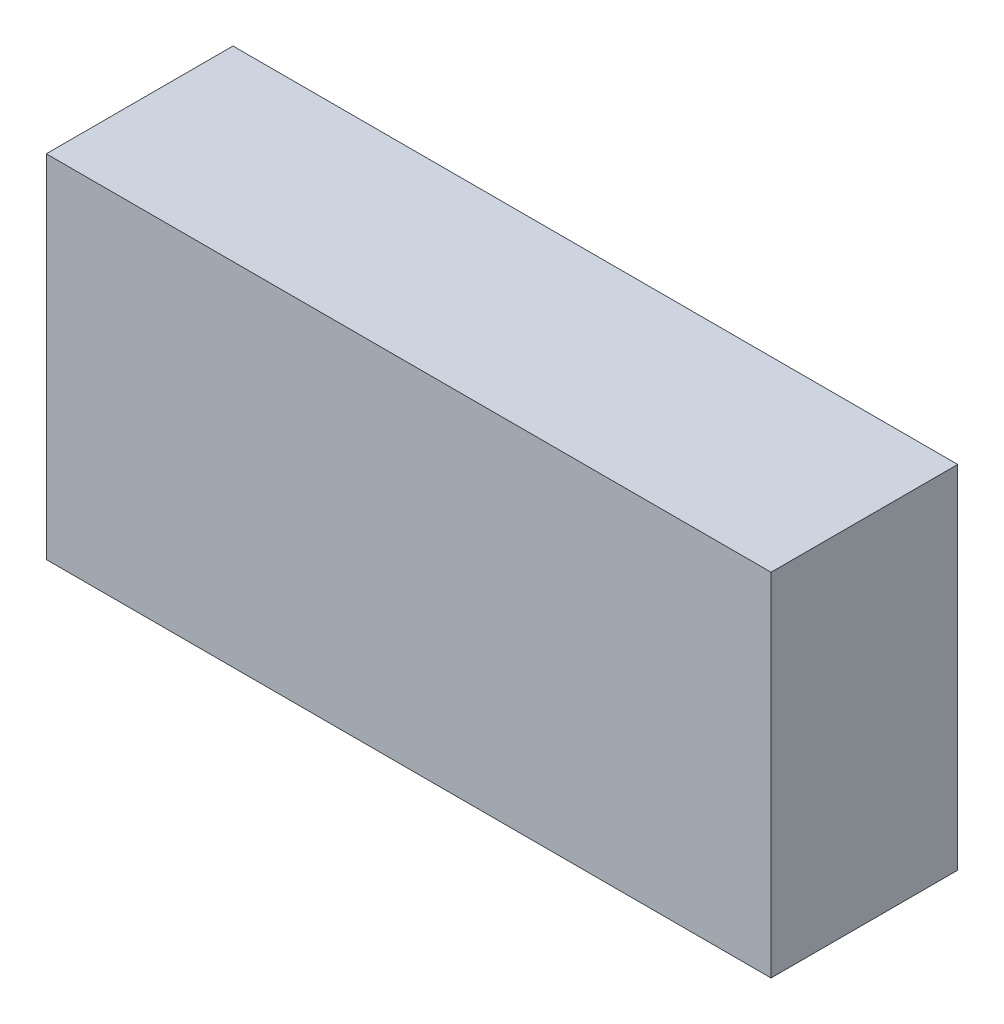
ISO-10303-21;
HEADER;
FILE_DESCRIPTION(('STEP AP214'),'2;1');
FILE_NAME('part.step','',(''),(''),'','','');
FILE_SCHEMA(('AUTOMOTIVE_DESIGN { 1 0 10303 214 1 1 1 1 }'));
ENDSEC;
DATA;
#1=APPLICATION_CONTEXT('core data for automotive mechanical design processes');
#2=APPLICATION_PROTOCOL_DEFINITION('international standard','automotive_design',2000,#1);
#3=PRODUCT_CONTEXT('',#1,'mechanical');
#4=PRODUCT('Part','Part','',(#3));
#5=PRODUCT_RELATED_PRODUCT_CATEGORY('part','',(#4));
#6=PRODUCT_DEFINITION_FORMATION('','',#4);
#7=PRODUCT_DEFINITION_CONTEXT('part definition',#1,'design');
#8=PRODUCT_DEFINITION('design','',#6,#7);
#9=PRODUCT_DEFINITION_SHAPE('','',#8);
#10=(LENGTH_UNIT() NAMED_UNIT(*) SI_UNIT(.MILLI.,.METRE.));
#11=(NAMED_UNIT(*) PLANE_ANGLE_UNIT() SI_UNIT($,.RADIAN.));
#12=(NAMED_UNIT(*) SI_UNIT($,.STERADIAN.) SOLID_ANGLE_UNIT());
#13=UNCERTAINTY_MEASURE_WITH_UNIT(LENGTH_MEASURE(1.E-05),#10,'distance_accuracy_value','');
#14=(GEOMETRIC_REPRESENTATION_CONTEXT(3) GLOBAL_UNCERTAINTY_ASSIGNED_CONTEXT((#13)) GLOBAL_UNIT_ASSIGNED_CONTEXT((#10,
#11,#12)) REPRESENTATION_CONTEXT('',''));
#15=CARTESIAN_POINT('',(0.,0.,0.));
#16=DIRECTION('',(0.,0.,1.));
#17=DIRECTION('',(1.,0.,0.));
#18=AXIS2_PLACEMENT_3D('',#15,#16,#17);
#19=CARTESIAN_POINT('',(-1.65,-0.8,0.));
#20=DIRECTION('',(1.,0.,0.));
#21=DIRECTION('',(0.,0.,1.));
#22=AXIS2_PLACEMENT_3D('',#19,#20,#21);
#23=PLANE('',#22);
#24=DIRECTION('',(0.,1.,0.));
#25=VECTOR('',#24,1.);
#26=CARTESIAN_POINT('',(-1.65,-0.8,0.85));
#27=LINE('',#26,#25);
#28=CARTESIAN_POINT('',(-1.65,-0.8,0.85));
#29=VERTEX_POINT('',#28);
#30=CARTESIAN_POINT('',(-1.65,0.800000000000001,0.85));
#31=VERTEX_POINT('',#30);
#32=EDGE_CURVE('P0_E11',#29,#31,#27,.T.);
#33=ORIENTED_EDGE('',*,*,#32,.T.);
#34=DIRECTION('',(0.,0.,1.));
#35=VECTOR('',#34,1.);
#36=CARTESIAN_POINT('',(-1.65,0.800000000000001,0.));
#37=LINE('',#36,#35);
#38=CARTESIAN_POINT('',(-1.65,0.800000000000001,0.));
#39=VERTEX_POINT('',#38);
#40=EDGE_CURVE('P0_E24',#39,#31,#37,.T.);
#41=ORIENTED_EDGE('',*,*,#40,.F.);
#42=DIRECTION('',(0.,1.,0.));
#43=VECTOR('',#42,1.);
#44=CARTESIAN_POINT('',(-1.65,-0.8,0.));
#45=LINE('',#44,#43);
#46=CARTESIAN_POINT('',(-1.65,-0.8,0.));
#47=VERTEX_POINT('',#46);
#48=EDGE_CURVE('P0_E86',#47,#39,#45,.T.);
#49=ORIENTED_EDGE('',*,*,#48,.F.);
#50=DIRECTION('',(0.,0.,1.));
#51=VECTOR('',#50,1.);
#52=CARTESIAN_POINT('',(-1.65,-0.8,0.));
#53=LINE('',#52,#51);
#54=EDGE_CURVE('P0_E36',#47,#29,#53,.T.);
#55=ORIENTED_EDGE('',*,*,#54,.T.);
#56=EDGE_LOOP('',(#33,#41,#49,#55));
#57=FACE_BOUND('',#56,.T.);
#58=ADVANCED_FACE('P0_F17',(#57),#23,.F.);
#59=CARTESIAN_POINT('',(1.65,-0.8,0.));
#60=DIRECTION('',(1.,0.,0.));
#61=DIRECTION('',(0.,0.,1.));
#62=AXIS2_PLACEMENT_3D('',#59,#60,#61);
#63=PLANE('',#62);
#64=DIRECTION('',(0.,0.,1.));
#65=VECTOR('',#64,1.);
#66=CARTESIAN_POINT('',(1.65,-0.8,0.));
#67=LINE('',#66,#65);
#68=CARTESIAN_POINT('',(1.65,-0.8,0.));
#69=VERTEX_POINT('',#68);
#70=CARTESIAN_POINT('',(1.65,-0.8,0.85));
#71=VERTEX_POINT('',#70);
#72=EDGE_CURVE('P0_E83',#69,#71,#67,.T.);
#73=ORIENTED_EDGE('',*,*,#72,.F.);
#74=DIRECTION('',(0.,1.,0.));
#75=VECTOR('',#74,1.);
#76=CARTESIAN_POINT('',(1.65,-0.8,0.));
#77=LINE('',#76,#75);
#78=CARTESIAN_POINT('',(1.65,0.8,0.));
#79=VERTEX_POINT('',#78);
#80=EDGE_CURVE('P0_E63',#69,#79,#77,.T.);
#81=ORIENTED_EDGE('',*,*,#80,.T.);
#82=DIRECTION('',(0.,0.,1.));
#83=VECTOR('',#82,1.);
#84=CARTESIAN_POINT('',(1.65,0.8,0.));
#85=LINE('',#84,#83);
#86=CARTESIAN_POINT('',(1.65,0.8,0.85));
#87=VERTEX_POINT('',#86);
#88=EDGE_CURVE('P0_E57',#79,#87,#85,.T.);
#89=ORIENTED_EDGE('',*,*,#88,.T.);
#90=DIRECTION('',(0.,1.,0.));
#91=VECTOR('',#90,1.);
#92=CARTESIAN_POINT('',(1.65,-0.8,0.85));
#93=LINE('',#92,#91);
#94=EDGE_CURVE('P0_E60',#71,#87,#93,.T.);
#95=ORIENTED_EDGE('',*,*,#94,.F.);
#96=EDGE_LOOP('',(#73,#81,#89,#95));
#97=FACE_BOUND('',#96,.T.);
#98=ADVANCED_FACE('P0_F59',(#97),#63,.T.);
#99=CARTESIAN_POINT('',(-1.65,-0.8,0.));
#100=DIRECTION('',(0.,1.,0.));
#101=DIRECTION('',(0.,0.,1.));
#102=AXIS2_PLACEMENT_3D('',#99,#100,#101);
#103=PLANE('',#102);
#104=ORIENTED_EDGE('',*,*,#72,.T.);
#105=DIRECTION('',(1.,0.,0.));
#106=VECTOR('',#105,1.);
#107=CARTESIAN_POINT('',(-1.65,-0.8,0.85));
#108=LINE('',#107,#106);
#109=EDGE_CURVE('P0_E71',#29,#71,#108,.T.);
#110=ORIENTED_EDGE('',*,*,#109,.F.);
#111=ORIENTED_EDGE('',*,*,#54,.F.);
#112=DIRECTION('',(1.,0.,0.));
#113=VECTOR('',#112,1.);
#114=CARTESIAN_POINT('',(-1.65,-0.8,0.));
#115=LINE('',#114,#113);
#116=EDGE_CURVE('P0_E76',#47,#69,#115,.T.);
#117=ORIENTED_EDGE('',*,*,#116,.T.);
#118=EDGE_LOOP('',(#104,#110,#111,#117));
#119=FACE_BOUND('',#118,.T.);
#120=ADVANCED_FACE('P0_F91',(#119),#103,.F.);
#121=CARTESIAN_POINT('',(-1.65,0.800000000000001,0.));
#122=DIRECTION('',(0.,1.,0.));
#123=DIRECTION('',(0.,0.,1.));
#124=AXIS2_PLACEMENT_3D('',#121,#122,#123);
#125=PLANE('',#124);
#126=DIRECTION('',(1.,0.,0.));
#127=VECTOR('',#126,1.);
#128=CARTESIAN_POINT('',(-1.65,0.800000000000001,0.));
#129=LINE('',#128,#127);
#130=EDGE_CURVE('P0_E74',#39,#79,#129,.T.);
#131=ORIENTED_EDGE('',*,*,#130,.F.);
#132=ORIENTED_EDGE('',*,*,#40,.T.);
#133=DIRECTION('',(1.,0.,0.));
#134=VECTOR('',#133,1.);
#135=CARTESIAN_POINT('',(-1.65,0.800000000000001,0.85));
#136=LINE('',#135,#134);
#137=EDGE_CURVE('P0_E69',#31,#87,#136,.T.);
#138=ORIENTED_EDGE('',*,*,#137,.T.);
#139=ORIENTED_EDGE('',*,*,#88,.F.);
#140=EDGE_LOOP('',(#131,#132,#138,#139));
#141=FACE_BOUND('',#140,.T.);
#142=ADVANCED_FACE('P0_F73',(#141),#125,.T.);
#143=CARTESIAN_POINT('',(-1.65,-0.8,0.));
#144=DIRECTION('',(0.,0.,1.));
#145=DIRECTION('',(1.,0.,0.));
#146=AXIS2_PLACEMENT_3D('',#143,#144,#145);
#147=PLANE('',#146);
#148=ORIENTED_EDGE('',*,*,#130,.T.);
#149=ORIENTED_EDGE('',*,*,#80,.F.);
#150=ORIENTED_EDGE('',*,*,#116,.F.);
#151=ORIENTED_EDGE('',*,*,#48,.T.);
#152=EDGE_LOOP('',(#148,#149,#150,#151));
#153=FACE_BOUND('',#152,.T.);
#154=ADVANCED_FACE('P0_F89',(#153),#147,.F.);
#155=CARTESIAN_POINT('',(-1.65,-0.8,0.85));
#156=DIRECTION('',(0.,0.,1.));
#157=DIRECTION('',(1.,0.,0.));
#158=AXIS2_PLACEMENT_3D('',#155,#156,#157);
#159=PLANE('',#158);
#160=ORIENTED_EDGE('',*,*,#32,.F.);
#161=ORIENTED_EDGE('',*,*,#109,.T.);
#162=ORIENTED_EDGE('',*,*,#94,.T.);
#163=ORIENTED_EDGE('',*,*,#137,.F.);
#164=EDGE_LOOP('',(#160,#161,#162,#163));
#165=FACE_BOUND('',#164,.T.);
#166=ADVANCED_FACE('P0_F68',(#165),#159,.T.);
#167=CLOSED_SHELL('',(#58,#98,#120,#142,#154,#166));
#168=MANIFOLD_SOLID_BREP('P0_B1',#167);
#169=CARTESIAN_POINT('',(-1.6,-0.75,-0.003333333333333));
#170=DIRECTION('',(1.,0.,0.));
#171=DIRECTION('',(0.,0.,1.));
#172=AXIS2_PLACEMENT_3D('',#169,#170,#171);
#173=PLANE('',#172);
#174=DIRECTION('',(0.,1.,0.));
#175=VECTOR('',#174,1.);
#176=CARTESIAN_POINT('',(-1.6,-0.75,0.006666666666667));
#177=LINE('',#176,#175);
#178=CARTESIAN_POINT('',(-1.6,-0.75,0.006666666666667));
#179=VERTEX_POINT('',#178);
#180=CARTESIAN_POINT('',(-1.6,0.750000000000001,0.006666666666667));
#181=VERTEX_POINT('',#180);
#182=EDGE_CURVE('P1_E11',#179,#181,#177,.T.);
#183=ORIENTED_EDGE('',*,*,#182,.T.);
#184=DIRECTION('',(0.,0.,1.));
#185=VECTOR('',#184,1.);
#186=CARTESIAN_POINT('',(-1.6,0.750000000000001,-0.003333333333333));
#187=LINE('',#186,#185);
#188=CARTESIAN_POINT('',(-1.6,0.750000000000001,-0.003333333333333));
#189=VERTEX_POINT('',#188);
#190=EDGE_CURVE('P1_E24',#189,#181,#187,.T.);
#191=ORIENTED_EDGE('',*,*,#190,.F.);
#192=DIRECTION('',(0.,1.,0.));
#193=VECTOR('',#192,1.);
#194=CARTESIAN_POINT('',(-1.6,-0.75,-0.003333333333333));
#195=LINE('',#194,#193);
#196=CARTESIAN_POINT('',(-1.6,-0.75,-0.003333333333333));
#197=VERTEX_POINT('',#196);
#198=EDGE_CURVE('P1_E86',#197,#189,#195,.T.);
#199=ORIENTED_EDGE('',*,*,#198,.F.);
#200=DIRECTION('',(0.,0.,1.));
#201=VECTOR('',#200,1.);
#202=CARTESIAN_POINT('',(-1.6,-0.75,-0.003333333333333));
#203=LINE('',#202,#201);
#204=EDGE_CURVE('P1_E36',#197,#179,#203,.T.);
#205=ORIENTED_EDGE('',*,*,#204,.T.);
#206=EDGE_LOOP('',(#183,#191,#199,#205));
#207=FACE_BOUND('',#206,.T.);
#208=ADVANCED_FACE('P1_F17',(#207),#173,.F.);
#209=CARTESIAN_POINT('',(-0.6,-0.75,-0.003333333333333));
#210=DIRECTION('',(1.,0.,0.));
#211=DIRECTION('',(0.,0.,1.));
#212=AXIS2_PLACEMENT_3D('',#209,#210,#211);
#213=PLANE('',#212);
#214=DIRECTION('',(0.,0.,1.));
#215=VECTOR('',#214,1.);
#216=CARTESIAN_POINT('',(-0.6,-0.75,-0.003333333333333));
#217=LINE('',#216,#215);
#218=CARTESIAN_POINT('',(-0.6,-0.75,-0.003333333333333));
#219=VERTEX_POINT('',#218);
#220=CARTESIAN_POINT('',(-0.6,-0.75,0.006666666666667));
#221=VERTEX_POINT('',#220);
#222=EDGE_CURVE('P1_E83',#219,#221,#217,.T.);
#223=ORIENTED_EDGE('',*,*,#222,.F.);
#224=DIRECTION('',(0.,1.,0.));
#225=VECTOR('',#224,1.);
#226=CARTESIAN_POINT('',(-0.6,-0.75,-0.003333333333333));
#227=LINE('',#226,#225);
#228=CARTESIAN_POINT('',(-0.6,0.75,-0.003333333333333));
#229=VERTEX_POINT('',#228);
#230=EDGE_CURVE('P1_E63',#219,#229,#227,.T.);
#231=ORIENTED_EDGE('',*,*,#230,.T.);
#232=DIRECTION('',(0.,0.,1.));
#233=VECTOR('',#232,1.);
#234=CARTESIAN_POINT('',(-0.6,0.75,-0.003333333333333));
#235=LINE('',#234,#233);
#236=CARTESIAN_POINT('',(-0.6,0.75,0.006666666666667));
#237=VERTEX_POINT('',#236);
#238=EDGE_CURVE('P1_E57',#229,#237,#235,.T.);
#239=ORIENTED_EDGE('',*,*,#238,.T.);
#240=DIRECTION('',(0.,1.,0.));
#241=VECTOR('',#240,1.);
#242=CARTESIAN_POINT('',(-0.6,-0.75,0.006666666666667));
#243=LINE('',#242,#241);
#244=EDGE_CURVE('P1_E60',#221,#237,#243,.T.);
#245=ORIENTED_EDGE('',*,*,#244,.F.);
#246=EDGE_LOOP('',(#223,#231,#239,#245));
#247=FACE_BOUND('',#246,.T.);
#248=ADVANCED_FACE('P1_F59',(#247),#213,.T.);
#249=CARTESIAN_POINT('',(-1.6,-0.75,-0.003333333333333));
#250=DIRECTION('',(0.,1.,0.));
#251=DIRECTION('',(0.,0.,1.));
#252=AXIS2_PLACEMENT_3D('',#249,#250,#251);
#253=PLANE('',#252);
#254=ORIENTED_EDGE('',*,*,#222,.T.);
#255=DIRECTION('',(1.,0.,0.));
#256=VECTOR('',#255,1.);
#257=CARTESIAN_POINT('',(-1.6,-0.75,0.006666666666667));
#258=LINE('',#257,#256);
#259=EDGE_CURVE('P1_E71',#179,#221,#258,.T.);
#260=ORIENTED_EDGE('',*,*,#259,.F.);
#261=ORIENTED_EDGE('',*,*,#204,.F.);
#262=DIRECTION('',(1.,0.,0.));
#263=VECTOR('',#262,1.);
#264=CARTESIAN_POINT('',(-1.6,-0.75,-0.003333333333333));
#265=LINE('',#264,#263);
#266=EDGE_CURVE('P1_E76',#197,#219,#265,.T.);
#267=ORIENTED_EDGE('',*,*,#266,.T.);
#268=EDGE_LOOP('',(#254,#260,#261,#267));
#269=FACE_BOUND('',#268,.T.);
#270=ADVANCED_FACE('P1_F91',(#269),#253,.F.);
#271=CARTESIAN_POINT('',(-1.6,0.750000000000001,-0.003333333333333));
#272=DIRECTION('',(0.,1.,0.));
#273=DIRECTION('',(0.,0.,1.));
#274=AXIS2_PLACEMENT_3D('',#271,#272,#273);
#275=PLANE('',#274);
#276=DIRECTION('',(1.,0.,0.));
#277=VECTOR('',#276,1.);
#278=CARTESIAN_POINT('',(-1.6,0.750000000000001,-0.003333333333333));
#279=LINE('',#278,#277);
#280=EDGE_CURVE('P1_E74',#189,#229,#279,.T.);
#281=ORIENTED_EDGE('',*,*,#280,.F.);
#282=ORIENTED_EDGE('',*,*,#190,.T.);
#283=DIRECTION('',(1.,0.,0.));
#284=VECTOR('',#283,1.);
#285=CARTESIAN_POINT('',(-1.6,0.750000000000001,0.006666666666667));
#286=LINE('',#285,#284);
#287=EDGE_CURVE('P1_E69',#181,#237,#286,.T.);
#288=ORIENTED_EDGE('',*,*,#287,.T.);
#289=ORIENTED_EDGE('',*,*,#238,.F.);
#290=EDGE_LOOP('',(#281,#282,#288,#289));
#291=FACE_BOUND('',#290,.T.);
#292=ADVANCED_FACE('P1_F73',(#291),#275,.T.);
#293=CARTESIAN_POINT('',(-1.6,-0.75,-0.003333333333333));
#294=DIRECTION('',(0.,0.,1.));
#295=DIRECTION('',(1.,0.,0.));
#296=AXIS2_PLACEMENT_3D('',#293,#294,#295);
#297=PLANE('',#296);
#298=ORIENTED_EDGE('',*,*,#280,.T.);
#299=ORIENTED_EDGE('',*,*,#230,.F.);
#300=ORIENTED_EDGE('',*,*,#266,.F.);
#301=ORIENTED_EDGE('',*,*,#198,.T.);
#302=EDGE_LOOP('',(#298,#299,#300,#301));
#303=FACE_BOUND('',#302,.T.);
#304=ADVANCED_FACE('P1_F89',(#303),#297,.F.);
#305=CARTESIAN_POINT('',(-1.6,-0.75,0.006666666666667));
#306=DIRECTION('',(0.,0.,1.));
#307=DIRECTION('',(1.,0.,0.));
#308=AXIS2_PLACEMENT_3D('',#305,#306,#307);
#309=PLANE('',#308);
#310=ORIENTED_EDGE('',*,*,#182,.F.);
#311=ORIENTED_EDGE('',*,*,#259,.T.);
#312=ORIENTED_EDGE('',*,*,#244,.T.);
#313=ORIENTED_EDGE('',*,*,#287,.F.);
#314=EDGE_LOOP('',(#310,#311,#312,#313));
#315=FACE_BOUND('',#314,.T.);
#316=ADVANCED_FACE('P1_F68',(#315),#309,.T.);
#317=CLOSED_SHELL('',(#208,#248,#270,#292,#304,#316));
#318=MANIFOLD_SOLID_BREP('P1_B1',#317);
#319=CARTESIAN_POINT('',(0.6,-0.75,-0.003333333333333));
#320=DIRECTION('',(1.,0.,0.));
#321=DIRECTION('',(0.,0.,1.));
#322=AXIS2_PLACEMENT_3D('',#319,#320,#321);
#323=PLANE('',#322);
#324=DIRECTION('',(0.,1.,0.));
#325=VECTOR('',#324,1.);
#326=CARTESIAN_POINT('',(0.6,-0.75,0.006666666666667));
#327=LINE('',#326,#325);
#328=CARTESIAN_POINT('',(0.6,-0.75,0.006666666666667));
#329=VERTEX_POINT('',#328);
#330=CARTESIAN_POINT('',(0.6,0.75,0.006666666666667));
#331=VERTEX_POINT('',#330);
#332=EDGE_CURVE('P2_E10',#329,#331,#327,.T.);
#333=ORIENTED_EDGE('',*,*,#332,.T.);
#334=DIRECTION('',(0.,0.,1.));
#335=VECTOR('',#334,1.);
#336=CARTESIAN_POINT('',(0.6,0.75,-0.003333333333333));
#337=LINE('',#336,#335);
#338=CARTESIAN_POINT('',(0.6,0.75,-0.003333333333333));
#339=VERTEX_POINT('',#338);
#340=EDGE_CURVE('P2_E23',#339,#331,#337,.T.);
#341=ORIENTED_EDGE('',*,*,#340,.F.);
#342=DIRECTION('',(0.,1.,0.));
#343=VECTOR('',#342,1.);
#344=CARTESIAN_POINT('',(0.6,-0.75,-0.003333333333333));
#345=LINE('',#344,#343);
#346=CARTESIAN_POINT('',(0.6,-0.75,-0.003333333333333));
#347=VERTEX_POINT('',#346);
#348=EDGE_CURVE('P2_E85',#347,#339,#345,.T.);
#349=ORIENTED_EDGE('',*,*,#348,.F.);
#350=DIRECTION('',(0.,0.,1.));
#351=VECTOR('',#350,1.);
#352=CARTESIAN_POINT('',(0.6,-0.75,-0.003333333333333));
#353=LINE('',#352,#351);
#354=EDGE_CURVE('P2_E35',#347,#329,#353,.T.);
#355=ORIENTED_EDGE('',*,*,#354,.T.);
#356=EDGE_LOOP('',(#333,#341,#349,#355));
#357=FACE_BOUND('',#356,.T.);
#358=ADVANCED_FACE('P2_F16',(#357),#323,.F.);
#359=CARTESIAN_POINT('',(1.6,-0.75,-0.003333333333333));
#360=DIRECTION('',(1.,0.,0.));
#361=DIRECTION('',(0.,0.,1.));
#362=AXIS2_PLACEMENT_3D('',#359,#360,#361);
#363=PLANE('',#362);
#364=DIRECTION('',(0.,0.,1.));
#365=VECTOR('',#364,1.);
#366=CARTESIAN_POINT('',(1.6,-0.75,-0.003333333333333));
#367=LINE('',#366,#365);
#368=CARTESIAN_POINT('',(1.6,-0.75,-0.003333333333333));
#369=VERTEX_POINT('',#368);
#370=CARTESIAN_POINT('',(1.6,-0.75,0.006666666666667));
#371=VERTEX_POINT('',#370);
#372=EDGE_CURVE('P2_E82',#369,#371,#367,.T.);
#373=ORIENTED_EDGE('',*,*,#372,.F.);
#374=DIRECTION('',(0.,1.,0.));
#375=VECTOR('',#374,1.);
#376=CARTESIAN_POINT('',(1.6,-0.75,-0.003333333333333));
#377=LINE('',#376,#375);
#378=CARTESIAN_POINT('',(1.6,0.75,-0.003333333333333));
#379=VERTEX_POINT('',#378);
#380=EDGE_CURVE('P2_E62',#369,#379,#377,.T.);
#381=ORIENTED_EDGE('',*,*,#380,.T.);
#382=DIRECTION('',(0.,0.,1.));
#383=VECTOR('',#382,1.);
#384=CARTESIAN_POINT('',(1.6,0.75,-0.003333333333333));
#385=LINE('',#384,#383);
#386=CARTESIAN_POINT('',(1.6,0.75,0.006666666666667));
#387=VERTEX_POINT('',#386);
#388=EDGE_CURVE('P2_E56',#379,#387,#385,.T.);
#389=ORIENTED_EDGE('',*,*,#388,.T.);
#390=DIRECTION('',(0.,1.,0.));
#391=VECTOR('',#390,1.);
#392=CARTESIAN_POINT('',(1.6,-0.75,0.006666666666667));
#393=LINE('',#392,#391);
#394=EDGE_CURVE('P2_E59',#371,#387,#393,.T.);
#395=ORIENTED_EDGE('',*,*,#394,.F.);
#396=EDGE_LOOP('',(#373,#381,#389,#395));
#397=FACE_BOUND('',#396,.T.);
#398=ADVANCED_FACE('P2_F58',(#397),#363,.T.);
#399=CARTESIAN_POINT('',(0.6,-0.75,-0.003333333333333));
#400=DIRECTION('',(0.,1.,0.));
#401=DIRECTION('',(0.,0.,1.));
#402=AXIS2_PLACEMENT_3D('',#399,#400,#401);
#403=PLANE('',#402);
#404=ORIENTED_EDGE('',*,*,#372,.T.);
#405=DIRECTION('',(1.,0.,0.));
#406=VECTOR('',#405,1.);
#407=CARTESIAN_POINT('',(0.6,-0.75,0.006666666666667));
#408=LINE('',#407,#406);
#409=EDGE_CURVE('P2_E70',#329,#371,#408,.T.);
#410=ORIENTED_EDGE('',*,*,#409,.F.);
#411=ORIENTED_EDGE('',*,*,#354,.F.);
#412=DIRECTION('',(1.,0.,0.));
#413=VECTOR('',#412,1.);
#414=CARTESIAN_POINT('',(0.6,-0.75,-0.003333333333333));
#415=LINE('',#414,#413);
#416=EDGE_CURVE('P2_E75',#347,#369,#415,.T.);
#417=ORIENTED_EDGE('',*,*,#416,.T.);
#418=EDGE_LOOP('',(#404,#410,#411,#417));
#419=FACE_BOUND('',#418,.T.);
#420=ADVANCED_FACE('P2_F90',(#419),#403,.F.);
#421=CARTESIAN_POINT('',(0.6,0.75,-0.003333333333333));
#422=DIRECTION('',(0.,1.,0.));
#423=DIRECTION('',(0.,0.,1.));
#424=AXIS2_PLACEMENT_3D('',#421,#422,#423);
#425=PLANE('',#424);
#426=DIRECTION('',(1.,0.,0.));
#427=VECTOR('',#426,1.);
#428=CARTESIAN_POINT('',(0.6,0.75,-0.003333333333333));
#429=LINE('',#428,#427);
#430=EDGE_CURVE('P2_E73',#339,#379,#429,.T.);
#431=ORIENTED_EDGE('',*,*,#430,.F.);
#432=ORIENTED_EDGE('',*,*,#340,.T.);
#433=DIRECTION('',(1.,0.,0.));
#434=VECTOR('',#433,1.);
#435=CARTESIAN_POINT('',(0.6,0.75,0.006666666666667));
#436=LINE('',#435,#434);
#437=EDGE_CURVE('P2_E68',#331,#387,#436,.T.);
#438=ORIENTED_EDGE('',*,*,#437,.T.);
#439=ORIENTED_EDGE('',*,*,#388,.F.);
#440=EDGE_LOOP('',(#431,#432,#438,#439));
#441=FACE_BOUND('',#440,.T.);
#442=ADVANCED_FACE('P2_F72',(#441),#425,.T.);
#443=CARTESIAN_POINT('',(0.6,-0.75,-0.003333333333333));
#444=DIRECTION('',(0.,0.,1.));
#445=DIRECTION('',(1.,0.,0.));
#446=AXIS2_PLACEMENT_3D('',#443,#444,#445);
#447=PLANE('',#446);
#448=ORIENTED_EDGE('',*,*,#430,.T.);
#449=ORIENTED_EDGE('',*,*,#380,.F.);
#450=ORIENTED_EDGE('',*,*,#416,.F.);
#451=ORIENTED_EDGE('',*,*,#348,.T.);
#452=EDGE_LOOP('',(#448,#449,#450,#451));
#453=FACE_BOUND('',#452,.T.);
#454=ADVANCED_FACE('P2_F88',(#453),#447,.F.);
#455=CARTESIAN_POINT('',(0.6,-0.75,0.006666666666667));
#456=DIRECTION('',(0.,0.,1.));
#457=DIRECTION('',(1.,0.,0.));
#458=AXIS2_PLACEMENT_3D('',#455,#456,#457);
#459=PLANE('',#458);
#460=ORIENTED_EDGE('',*,*,#332,.F.);
#461=ORIENTED_EDGE('',*,*,#409,.T.);
#462=ORIENTED_EDGE('',*,*,#394,.T.);
#463=ORIENTED_EDGE('',*,*,#437,.F.);
#464=EDGE_LOOP('',(#460,#461,#462,#463));
#465=FACE_BOUND('',#464,.T.);
#466=ADVANCED_FACE('P2_F67',(#465),#459,.T.);
#467=CLOSED_SHELL('',(#358,#398,#420,#442,#454,#466));
#468=MANIFOLD_SOLID_BREP('P2_B1',#467);
#469=ADVANCED_BREP_SHAPE_REPRESENTATION('',(#18,#168,#318,#468),#14);
#470=SHAPE_DEFINITION_REPRESENTATION(#9,#469);
ENDSEC;
END-ISO-10303-21;
